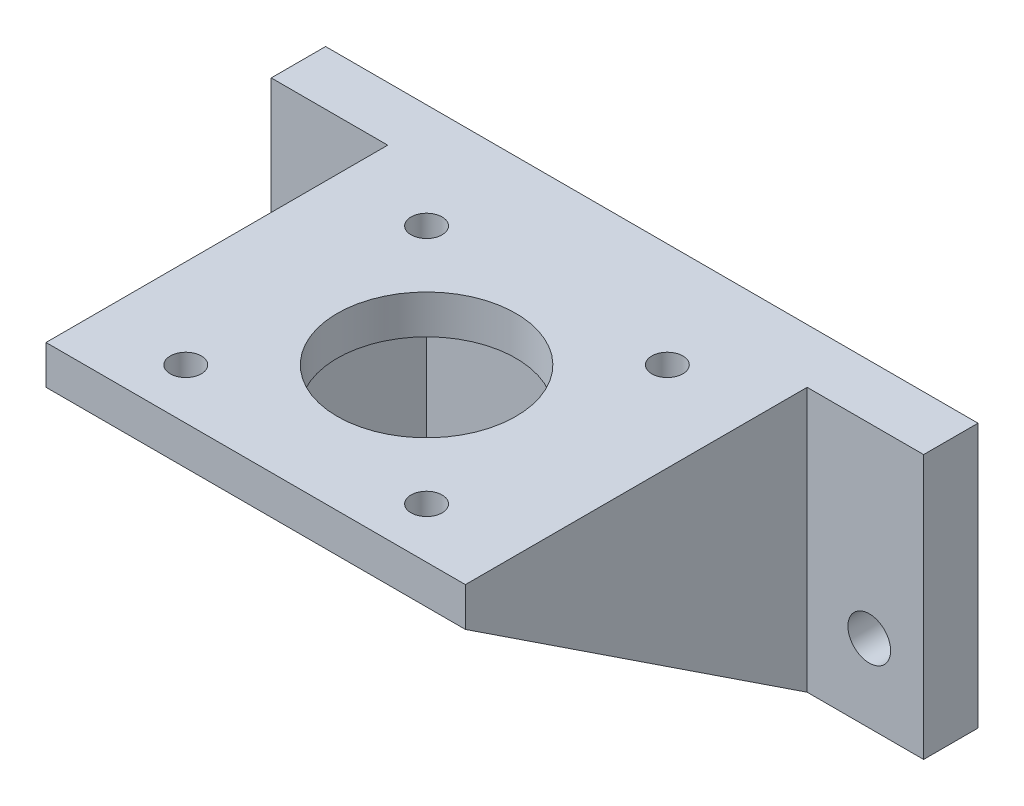
ISO-10303-21;
HEADER;
FILE_DESCRIPTION(('STEP AP214'),'2;1');
FILE_NAME('part.step','',(''),(''),'','','');
FILE_SCHEMA(('AUTOMOTIVE_DESIGN { 1 0 10303 214 1 1 1 1 }'));
ENDSEC;
DATA;
#1=APPLICATION_CONTEXT('core data for automotive mechanical design processes');
#2=APPLICATION_PROTOCOL_DEFINITION('international standard','automotive_design',2000,#1);
#3=PRODUCT_CONTEXT('',#1,'mechanical');
#4=PRODUCT('Part','Part','',(#3));
#5=PRODUCT_RELATED_PRODUCT_CATEGORY('part','',(#4));
#6=PRODUCT_DEFINITION_FORMATION('','',#4);
#7=PRODUCT_DEFINITION_CONTEXT('part definition',#1,'design');
#8=PRODUCT_DEFINITION('design','',#6,#7);
#9=PRODUCT_DEFINITION_SHAPE('','',#8);
#10=(LENGTH_UNIT() NAMED_UNIT(*) SI_UNIT(.MILLI.,.METRE.));
#11=(NAMED_UNIT(*) PLANE_ANGLE_UNIT() SI_UNIT($,.RADIAN.));
#12=(NAMED_UNIT(*) SI_UNIT($,.STERADIAN.) SOLID_ANGLE_UNIT());
#13=UNCERTAINTY_MEASURE_WITH_UNIT(LENGTH_MEASURE(1.E-05),#10,'distance_accuracy_value','');
#14=(GEOMETRIC_REPRESENTATION_CONTEXT(3) GLOBAL_UNCERTAINTY_ASSIGNED_CONTEXT((#13)) GLOBAL_UNIT_ASSIGNED_CONTEXT((#10,
#11,#12)) REPRESENTATION_CONTEXT('',''));
#15=CARTESIAN_POINT('',(0.,0.,0.));
#16=DIRECTION('',(0.,0.,1.));
#17=DIRECTION('',(1.,0.,0.));
#18=AXIS2_PLACEMENT_3D('',#15,#16,#17);
#19=CARTESIAN_POINT('',(0.,0.,-44.));
#20=DIRECTION('',(0.,0.,-1.));
#21=DIRECTION('',(-1.,0.,0.));
#22=AXIS2_PLACEMENT_3D('',#19,#20,#21);
#23=PLANE('',#22);
#24=CARTESIAN_POINT('',(-13.,-19.,-44.));
#25=DIRECTION('',(0.,0.,-1.));
#26=DIRECTION('',(-1.,0.,0.));
#27=AXIS2_PLACEMENT_3D('',#24,#25,#26);
#28=CIRCLE('',#27,2.75);
#29=CARTESIAN_POINT('',(-15.75,-19.,-44.));
#30=VERTEX_POINT('',#29);
#31=EDGE_CURVE('E165',#30,#30,#28,.T.);
#32=ORIENTED_EDGE('',*,*,#31,.T.);
#33=EDGE_LOOP('',(#32));
#34=FACE_BOUND('',#33,.T.);
#35=DIRECTION('',(0.,-1.,0.));
#36=VECTOR('',#35,1.);
#37=CARTESIAN_POINT('',(-5.,0.,-44.));
#38=LINE('',#37,#36);
#39=CARTESIAN_POINT('',(-5.,5.,-44.));
#40=VERTEX_POINT('',#39);
#41=CARTESIAN_POINT('',(-4.99999999999998,-29.,-44.));
#42=VERTEX_POINT('',#41);
#43=EDGE_CURVE('E121',#40,#42,#38,.T.);
#44=ORIENTED_EDGE('',*,*,#43,.F.);
#45=DIRECTION('',(1.,0.,0.));
#46=VECTOR('',#45,1.);
#47=CARTESIAN_POINT('',(64.,5.,-44.));
#48=LINE('',#47,#46);
#49=CARTESIAN_POINT('',(-20.,5.,-44.));
#50=VERTEX_POINT('',#49);
#51=EDGE_CURVE('E182',#50,#40,#48,.T.);
#52=ORIENTED_EDGE('',*,*,#51,.F.);
#53=DIRECTION('',(0.,1.,0.));
#54=VECTOR('',#53,1.);
#55=CARTESIAN_POINT('',(-20.,5.,-44.));
#56=LINE('',#55,#54);
#57=CARTESIAN_POINT('',(-20.,-29.,-44.));
#58=VERTEX_POINT('',#57);
#59=EDGE_CURVE('E195',#58,#50,#56,.T.);
#60=ORIENTED_EDGE('',*,*,#59,.F.);
#61=DIRECTION('',(-1.,0.,0.));
#62=VECTOR('',#61,1.);
#63=CARTESIAN_POINT('',(64.,-29.,-44.));
#64=LINE('',#63,#62);
#65=EDGE_CURVE('E191',#42,#58,#64,.T.);
#66=ORIENTED_EDGE('',*,*,#65,.F.);
#67=EDGE_LOOP('',(#44,#52,#60,#66));
#68=FACE_BOUND('',#67,.T.);
#69=ADVANCED_FACE('F33',(#34,#68),#23,.F.);
#70=CARTESIAN_POINT('',(57.,-19.,-44.));
#71=DIRECTION('',(0.,0.,-1.));
#72=DIRECTION('',(-1.,0.,0.));
#73=AXIS2_PLACEMENT_3D('',#70,#71,#72);
#74=CIRCLE('',#73,2.75);
#75=CARTESIAN_POINT('',(54.25,-19.,-44.));
#76=VERTEX_POINT('',#75);
#77=EDGE_CURVE('E169',#76,#76,#74,.T.);
#78=ORIENTED_EDGE('',*,*,#77,.T.);
#79=EDGE_LOOP('',(#78));
#80=FACE_BOUND('',#79,.T.);
#81=DIRECTION('',(0.,1.,0.));
#82=VECTOR('',#81,1.);
#83=CARTESIAN_POINT('',(49.,0.,-44.));
#84=LINE('',#83,#82);
#85=CARTESIAN_POINT('',(49.,-29.,-44.));
#86=VERTEX_POINT('',#85);
#87=CARTESIAN_POINT('',(49.,5.,-44.));
#88=VERTEX_POINT('',#87);
#89=EDGE_CURVE('E163',#86,#88,#84,.T.);
#90=ORIENTED_EDGE('',*,*,#89,.F.);
#91=CARTESIAN_POINT('',(64.,-29.,-44.));
#92=VERTEX_POINT('',#91);
#93=EDGE_CURVE('E192',#92,#86,#64,.T.);
#94=ORIENTED_EDGE('',*,*,#93,.F.);
#95=DIRECTION('',(0.,-1.,0.));
#96=VECTOR('',#95,1.);
#97=CARTESIAN_POINT('',(64.,5.,-44.));
#98=LINE('',#97,#96);
#99=CARTESIAN_POINT('',(64.,5.,-44.));
#100=VERTEX_POINT('',#99);
#101=EDGE_CURVE('E175',#100,#92,#98,.T.);
#102=ORIENTED_EDGE('',*,*,#101,.F.);
#103=EDGE_CURVE('E198',#88,#100,#48,.T.);
#104=ORIENTED_EDGE('',*,*,#103,.F.);
#105=EDGE_LOOP('',(#90,#94,#102,#104));
#106=FACE_BOUND('',#105,.T.);
#107=ADVANCED_FACE('F270',(#80,#106),#23,.F.);
#108=CARTESIAN_POINT('',(0.,5.,0.));
#109=DIRECTION('',(0.,-1.,0.));
#110=DIRECTION('',(0.,0.,-1.));
#111=AXIS2_PLACEMENT_3D('',#108,#109,#110);
#112=PLANE('',#111);
#113=DIRECTION('',(0.,0.,1.));
#114=VECTOR('',#113,1.);
#115=CARTESIAN_POINT('',(64.,5.,-51.));
#116=LINE('',#115,#114);
#117=CARTESIAN_POINT('',(64.,5.,-51.));
#118=VERTEX_POINT('',#117);
#119=EDGE_CURVE('E188',#118,#100,#116,.T.);
#120=ORIENTED_EDGE('',*,*,#119,.F.);
#121=DIRECTION('',(1.,0.,0.));
#122=VECTOR('',#121,1.);
#123=CARTESIAN_POINT('',(64.,5.,-51.));
#124=LINE('',#123,#122);
#125=CARTESIAN_POINT('',(-20.,5.,-51.));
#126=VERTEX_POINT('',#125);
#127=EDGE_CURVE('E186',#126,#118,#124,.T.);
#128=ORIENTED_EDGE('',*,*,#127,.F.);
#129=DIRECTION('',(0.,0.,1.));
#130=VECTOR('',#129,1.);
#131=CARTESIAN_POINT('',(-20.,5.,-51.));
#132=LINE('',#131,#130);
#133=EDGE_CURVE('E203',#126,#50,#132,.T.);
#134=ORIENTED_EDGE('',*,*,#133,.T.);
#135=ORIENTED_EDGE('',*,*,#51,.T.);
#136=DIRECTION('',(0.,0.,-1.));
#137=VECTOR('',#136,1.);
#138=CARTESIAN_POINT('',(-5.,5.,-51.));
#139=LINE('',#138,#137);
#140=CARTESIAN_POINT('',(-5.,5.,0.));
#141=VERTEX_POINT('',#140);
#142=EDGE_CURVE('E134',#141,#40,#139,.T.);
#143=ORIENTED_EDGE('',*,*,#142,.F.);
#144=DIRECTION('',(1.,0.,0.));
#145=VECTOR('',#144,1.);
#146=CARTESIAN_POINT('',(0.,5.,0.));
#147=LINE('',#146,#145);
#148=CARTESIAN_POINT('',(49.,5.,0.));
#149=VERTEX_POINT('',#148);
#150=EDGE_CURVE('E11',#141,#149,#147,.T.);
#151=ORIENTED_EDGE('',*,*,#150,.T.);
#152=DIRECTION('',(0.,0.,1.));
#153=VECTOR('',#152,1.);
#154=CARTESIAN_POINT('',(49.,5.,0.));
#155=LINE('',#154,#153);
#156=EDGE_CURVE('E151',#88,#149,#155,.T.);
#157=ORIENTED_EDGE('',*,*,#156,.F.);
#158=ORIENTED_EDGE('',*,*,#103,.T.);
#159=EDGE_LOOP('',(#120,#128,#134,#135,#143,#151,#157,#158));
#160=FACE_BOUND('',#159,.T.);
#161=CARTESIAN_POINT('',(6.5,5.,-37.5));
#162=DIRECTION('',(0.,1.,0.));
#163=DIRECTION('',(0.,0.,1.));
#164=AXIS2_PLACEMENT_3D('',#161,#162,#163);
#165=CIRCLE('',#164,2.);
#166=CARTESIAN_POINT('',(6.5,5.,-35.5));
#167=VERTEX_POINT('',#166);
#168=EDGE_CURVE('E237',#167,#167,#165,.T.);
#169=ORIENTED_EDGE('',*,*,#168,.F.);
#170=EDGE_LOOP('',(#169));
#171=FACE_BOUND('',#170,.T.);
#172=CARTESIAN_POINT('',(6.50000000000003,5.,-6.5));
#173=DIRECTION('',(0.,1.,0.));
#174=DIRECTION('',(0.,0.,1.));
#175=AXIS2_PLACEMENT_3D('',#172,#173,#174);
#176=CIRCLE('',#175,2.);
#177=CARTESIAN_POINT('',(6.50000000000003,5.,-4.5));
#178=VERTEX_POINT('',#177);
#179=EDGE_CURVE('E231',#178,#178,#176,.T.);
#180=ORIENTED_EDGE('',*,*,#179,.F.);
#181=EDGE_LOOP('',(#180));
#182=FACE_BOUND('',#181,.T.);
#183=CARTESIAN_POINT('',(37.5,5.,-6.5));
#184=DIRECTION('',(0.,1.,0.));
#185=DIRECTION('',(0.,0.,1.));
#186=AXIS2_PLACEMENT_3D('',#183,#184,#185);
#187=CIRCLE('',#186,2.);
#188=CARTESIAN_POINT('',(37.5,5.,-4.5));
#189=VERTEX_POINT('',#188);
#190=EDGE_CURVE('E225',#189,#189,#187,.T.);
#191=ORIENTED_EDGE('',*,*,#190,.F.);
#192=EDGE_LOOP('',(#191));
#193=FACE_BOUND('',#192,.T.);
#194=CARTESIAN_POINT('',(37.5,5.,-37.5));
#195=DIRECTION('',(0.,1.,0.));
#196=DIRECTION('',(0.,0.,1.));
#197=AXIS2_PLACEMENT_3D('',#194,#195,#196);
#198=CIRCLE('',#197,2.);
#199=CARTESIAN_POINT('',(37.5,5.,-35.5));
#200=VERTEX_POINT('',#199);
#201=EDGE_CURVE('E219',#200,#200,#198,.T.);
#202=ORIENTED_EDGE('',*,*,#201,.F.);
#203=EDGE_LOOP('',(#202));
#204=FACE_BOUND('',#203,.T.);
#205=CARTESIAN_POINT('',(22.,5.,-22.));
#206=DIRECTION('',(0.,1.,0.));
#207=DIRECTION('',(0.,0.,1.));
#208=AXIS2_PLACEMENT_3D('',#205,#206,#207);
#209=CIRCLE('',#208,11.5);
#210=CARTESIAN_POINT('',(22.,5.,-10.5));
#211=VERTEX_POINT('',#210);
#212=EDGE_CURVE('E213',#211,#211,#209,.T.);
#213=ORIENTED_EDGE('',*,*,#212,.F.);
#214=EDGE_LOOP('',(#213));
#215=FACE_BOUND('',#214,.T.);
#216=ADVANCED_FACE('F276',(#160,#171,#182,#193,#204,#215),#112,.F.);
#217=CARTESIAN_POINT('',(0.,0.,0.));
#218=DIRECTION('',(0.,-1.,0.));
#219=DIRECTION('',(0.,0.,-1.));
#220=AXIS2_PLACEMENT_3D('',#217,#218,#219);
#221=PLANE('',#220);
#222=CARTESIAN_POINT('',(37.5,0.,-37.5));
#223=DIRECTION('',(0.,1.,0.));
#224=DIRECTION('',(0.,0.,1.));
#225=AXIS2_PLACEMENT_3D('',#222,#223,#224);
#226=CIRCLE('',#225,2.);
#227=CARTESIAN_POINT('',(37.5,0.,-35.5));
#228=VERTEX_POINT('',#227);
#229=EDGE_CURVE('E216',#228,#228,#226,.T.);
#230=ORIENTED_EDGE('',*,*,#229,.T.);
#231=EDGE_LOOP('',(#230));
#232=FACE_BOUND('',#231,.T.);
#233=CARTESIAN_POINT('',(6.50000000000003,0.,-6.5));
#234=DIRECTION('',(0.,1.,0.));
#235=DIRECTION('',(0.,0.,1.));
#236=AXIS2_PLACEMENT_3D('',#233,#234,#235);
#237=CIRCLE('',#236,2.);
#238=CARTESIAN_POINT('',(6.50000000000003,0.,-4.5));
#239=VERTEX_POINT('',#238);
#240=EDGE_CURVE('E228',#239,#239,#237,.T.);
#241=ORIENTED_EDGE('',*,*,#240,.T.);
#242=EDGE_LOOP('',(#241));
#243=FACE_BOUND('',#242,.T.);
#244=DIRECTION('',(0.,0.,1.));
#245=VECTOR('',#244,1.);
#246=CARTESIAN_POINT('',(0.,0.,0.));
#247=LINE('',#246,#245);
#248=CARTESIAN_POINT('',(0.,0.,-44.));
#249=VERTEX_POINT('',#248);
#250=CARTESIAN_POINT('',(0.,0.,0.));
#251=VERTEX_POINT('',#250);
#252=EDGE_CURVE('E240',#249,#251,#247,.T.);
#253=ORIENTED_EDGE('',*,*,#252,.F.);
#254=DIRECTION('',(-1.,0.,0.));
#255=VECTOR('',#254,1.);
#256=CARTESIAN_POINT('',(0.,0.,-44.));
#257=LINE('',#256,#255);
#258=CARTESIAN_POINT('',(44.,0.,-44.));
#259=VERTEX_POINT('',#258);
#260=EDGE_CURVE('E37',#259,#249,#257,.T.);
#261=ORIENTED_EDGE('',*,*,#260,.F.);
#262=DIRECTION('',(0.,0.,-1.));
#263=VECTOR('',#262,1.);
#264=CARTESIAN_POINT('',(44.,0.,0.));
#265=LINE('',#264,#263);
#266=CARTESIAN_POINT('',(44.,0.,0.));
#267=VERTEX_POINT('',#266);
#268=EDGE_CURVE('E245',#267,#259,#265,.T.);
#269=ORIENTED_EDGE('',*,*,#268,.F.);
#270=DIRECTION('',(1.,0.,0.));
#271=VECTOR('',#270,1.);
#272=CARTESIAN_POINT('',(0.,0.,0.));
#273=LINE('',#272,#271);
#274=EDGE_CURVE('E244',#251,#267,#273,.T.);
#275=ORIENTED_EDGE('',*,*,#274,.F.);
#276=EDGE_LOOP('',(#253,#261,#269,#275));
#277=FACE_BOUND('',#276,.T.);
#278=CARTESIAN_POINT('',(6.5,0.,-37.5));
#279=DIRECTION('',(0.,1.,0.));
#280=DIRECTION('',(0.,0.,1.));
#281=AXIS2_PLACEMENT_3D('',#278,#279,#280);
#282=CIRCLE('',#281,2.);
#283=CARTESIAN_POINT('',(6.5,0.,-35.5));
#284=VERTEX_POINT('',#283);
#285=EDGE_CURVE('E234',#284,#284,#282,.T.);
#286=ORIENTED_EDGE('',*,*,#285,.T.);
#287=EDGE_LOOP('',(#286));
#288=FACE_BOUND('',#287,.T.);
#289=CARTESIAN_POINT('',(37.5,0.,-6.5));
#290=DIRECTION('',(0.,1.,0.));
#291=DIRECTION('',(0.,0.,1.));
#292=AXIS2_PLACEMENT_3D('',#289,#290,#291);
#293=CIRCLE('',#292,2.);
#294=CARTESIAN_POINT('',(37.5,0.,-4.5));
#295=VERTEX_POINT('',#294);
#296=EDGE_CURVE('E222',#295,#295,#293,.T.);
#297=ORIENTED_EDGE('',*,*,#296,.T.);
#298=EDGE_LOOP('',(#297));
#299=FACE_BOUND('',#298,.T.);
#300=CARTESIAN_POINT('',(22.,0.,-22.));
#301=DIRECTION('',(0.,1.,0.));
#302=DIRECTION('',(0.,0.,1.));
#303=AXIS2_PLACEMENT_3D('',#300,#301,#302);
#304=CIRCLE('',#303,11.5);
#305=CARTESIAN_POINT('',(22.,0.,-10.5));
#306=VERTEX_POINT('',#305);
#307=EDGE_CURVE('E212',#306,#306,#304,.T.);
#308=ORIENTED_EDGE('',*,*,#307,.T.);
#309=EDGE_LOOP('',(#308));
#310=FACE_BOUND('',#309,.T.);
#311=ADVANCED_FACE('F256',(#232,#243,#277,#288,#299,#310),#221,.T.);
#312=CARTESIAN_POINT('',(0.,5.,0.));
#313=DIRECTION('',(0.,0.,-1.));
#314=DIRECTION('',(-1.,0.,0.));
#315=AXIS2_PLACEMENT_3D('',#312,#313,#314);
#316=PLANE('',#315);
#317=ORIENTED_EDGE('',*,*,#274,.T.);
#318=DIRECTION('',(-1.,0.,0.));
#319=VECTOR('',#318,1.);
#320=CARTESIAN_POINT('',(49.,0.,0.));
#321=LINE('',#320,#319);
#322=CARTESIAN_POINT('',(49.,0.,0.));
#323=VERTEX_POINT('',#322);
#324=EDGE_CURVE('E158',#323,#267,#321,.T.);
#325=ORIENTED_EDGE('',*,*,#324,.F.);
#326=DIRECTION('',(0.,-1.,0.));
#327=VECTOR('',#326,1.);
#328=CARTESIAN_POINT('',(49.,0.,0.));
#329=LINE('',#328,#327);
#330=EDGE_CURVE('E146',#149,#323,#329,.T.);
#331=ORIENTED_EDGE('',*,*,#330,.F.);
#332=ORIENTED_EDGE('',*,*,#150,.F.);
#333=DIRECTION('',(0.,1.,0.));
#334=VECTOR('',#333,1.);
#335=CARTESIAN_POINT('',(-5.,5.,0.));
#336=LINE('',#335,#334);
#337=CARTESIAN_POINT('',(-5.,0.,0.));
#338=VERTEX_POINT('',#337);
#339=EDGE_CURVE('E118',#338,#141,#336,.T.);
#340=ORIENTED_EDGE('',*,*,#339,.F.);
#341=DIRECTION('',(1.,0.,0.));
#342=VECTOR('',#341,1.);
#343=CARTESIAN_POINT('',(-5.,0.,0.));
#344=LINE('',#343,#342);
#345=EDGE_CURVE('E127',#338,#251,#344,.T.);
#346=ORIENTED_EDGE('',*,*,#345,.T.);
#347=EDGE_LOOP('',(#317,#325,#331,#332,#340,#346));
#348=FACE_BOUND('',#347,.T.);
#349=ADVANCED_FACE('F35',(#348),#316,.F.);
#350=CARTESIAN_POINT('',(6.5,5.,-37.5));
#351=DIRECTION('',(0.,-1.,0.));
#352=DIRECTION('',(0.,0.,-1.));
#353=AXIS2_PLACEMENT_3D('',#350,#351,#352);
#354=CYLINDRICAL_SURFACE('',#353,2.);
#355=ORIENTED_EDGE('',*,*,#168,.T.);
#356=EDGE_LOOP('',(#355));
#357=FACE_BOUND('',#356,.T.);
#358=ORIENTED_EDGE('',*,*,#285,.F.);
#359=EDGE_LOOP('',(#358));
#360=FACE_BOUND('',#359,.T.);
#361=ADVANCED_FACE('F356',(#357,#360),#354,.F.);
#362=CARTESIAN_POINT('',(6.50000000000003,5.,-6.5));
#363=DIRECTION('',(0.,-1.,0.));
#364=DIRECTION('',(0.,0.,-1.));
#365=AXIS2_PLACEMENT_3D('',#362,#363,#364);
#366=CYLINDRICAL_SURFACE('',#365,2.);
#367=ORIENTED_EDGE('',*,*,#179,.T.);
#368=EDGE_LOOP('',(#367));
#369=FACE_BOUND('',#368,.T.);
#370=ORIENTED_EDGE('',*,*,#240,.F.);
#371=EDGE_LOOP('',(#370));
#372=FACE_BOUND('',#371,.T.);
#373=ADVANCED_FACE('F352',(#369,#372),#366,.F.);
#374=CARTESIAN_POINT('',(37.5,5.,-6.5));
#375=DIRECTION('',(0.,-1.,0.));
#376=DIRECTION('',(0.,0.,-1.));
#377=AXIS2_PLACEMENT_3D('',#374,#375,#376);
#378=CYLINDRICAL_SURFACE('',#377,2.);
#379=ORIENTED_EDGE('',*,*,#190,.T.);
#380=EDGE_LOOP('',(#379));
#381=FACE_BOUND('',#380,.T.);
#382=ORIENTED_EDGE('',*,*,#296,.F.);
#383=EDGE_LOOP('',(#382));
#384=FACE_BOUND('',#383,.T.);
#385=ADVANCED_FACE('F348',(#381,#384),#378,.F.);
#386=CARTESIAN_POINT('',(37.5,5.,-37.5));
#387=DIRECTION('',(0.,-1.,0.));
#388=DIRECTION('',(0.,0.,-1.));
#389=AXIS2_PLACEMENT_3D('',#386,#387,#388);
#390=CYLINDRICAL_SURFACE('',#389,2.);
#391=ORIENTED_EDGE('',*,*,#201,.T.);
#392=EDGE_LOOP('',(#391));
#393=FACE_BOUND('',#392,.T.);
#394=ORIENTED_EDGE('',*,*,#229,.F.);
#395=EDGE_LOOP('',(#394));
#396=FACE_BOUND('',#395,.T.);
#397=ADVANCED_FACE('F296',(#393,#396),#390,.F.);
#398=CARTESIAN_POINT('',(22.,5.,-22.));
#399=DIRECTION('',(0.,-1.,0.));
#400=DIRECTION('',(0.,0.,-1.));
#401=AXIS2_PLACEMENT_3D('',#398,#399,#400);
#402=CYLINDRICAL_SURFACE('',#401,11.5);
#403=ORIENTED_EDGE('',*,*,#212,.T.);
#404=EDGE_LOOP('',(#403));
#405=FACE_BOUND('',#404,.T.);
#406=ORIENTED_EDGE('',*,*,#307,.F.);
#407=EDGE_LOOP('',(#406));
#408=FACE_BOUND('',#407,.T.);
#409=ADVANCED_FACE('F291',(#405,#408),#402,.F.);
#410=CARTESIAN_POINT('',(0.,0.,-51.));
#411=DIRECTION('',(0.,0.,-1.));
#412=DIRECTION('',(-1.,0.,0.));
#413=AXIS2_PLACEMENT_3D('',#410,#411,#412);
#414=PLANE('',#413);
#415=DIRECTION('',(-1.,0.,0.));
#416=VECTOR('',#415,1.);
#417=CARTESIAN_POINT('',(64.,-29.,-51.));
#418=LINE('',#417,#416);
#419=CARTESIAN_POINT('',(64.,-29.,-51.));
#420=VERTEX_POINT('',#419);
#421=CARTESIAN_POINT('',(-20.,-29.,-51.));
#422=VERTEX_POINT('',#421);
#423=EDGE_CURVE('E181',#420,#422,#418,.T.);
#424=ORIENTED_EDGE('',*,*,#423,.T.);
#425=DIRECTION('',(0.,1.,0.));
#426=VECTOR('',#425,1.);
#427=CARTESIAN_POINT('',(-20.,5.,-51.));
#428=LINE('',#427,#426);
#429=EDGE_CURVE('E184',#422,#126,#428,.T.);
#430=ORIENTED_EDGE('',*,*,#429,.T.);
#431=ORIENTED_EDGE('',*,*,#127,.T.);
#432=DIRECTION('',(0.,-1.,0.));
#433=VECTOR('',#432,1.);
#434=CARTESIAN_POINT('',(64.,5.,-51.));
#435=LINE('',#434,#433);
#436=EDGE_CURVE('E178',#118,#420,#435,.T.);
#437=ORIENTED_EDGE('',*,*,#436,.T.);
#438=EDGE_LOOP('',(#424,#430,#431,#437));
#439=FACE_BOUND('',#438,.T.);
#440=CARTESIAN_POINT('',(57.,-19.,-51.));
#441=DIRECTION('',(0.,0.,-1.));
#442=DIRECTION('',(-1.,0.,0.));
#443=AXIS2_PLACEMENT_3D('',#440,#441,#442);
#444=CIRCLE('',#443,2.75);
#445=CARTESIAN_POINT('',(54.25,-19.,-51.));
#446=VERTEX_POINT('',#445);
#447=EDGE_CURVE('E172',#446,#446,#444,.T.);
#448=ORIENTED_EDGE('',*,*,#447,.F.);
#449=EDGE_LOOP('',(#448));
#450=FACE_BOUND('',#449,.T.);
#451=CARTESIAN_POINT('',(-13.,-19.,-51.));
#452=DIRECTION('',(0.,0.,-1.));
#453=DIRECTION('',(-1.,0.,0.));
#454=AXIS2_PLACEMENT_3D('',#451,#452,#453);
#455=CIRCLE('',#454,2.75);
#456=CARTESIAN_POINT('',(-15.75,-19.,-51.));
#457=VERTEX_POINT('',#456);
#458=EDGE_CURVE('E166',#457,#457,#455,.T.);
#459=ORIENTED_EDGE('',*,*,#458,.F.);
#460=EDGE_LOOP('',(#459));
#461=FACE_BOUND('',#460,.T.);
#462=ADVANCED_FACE('F283',(#439,#450,#461),#414,.T.);
#463=ORIENTED_EDGE('',*,*,#260,.T.);
#464=DIRECTION('',(0.,-1.,0.));
#465=VECTOR('',#464,1.);
#466=CARTESIAN_POINT('',(0.,0.,-44.));
#467=LINE('',#466,#465);
#468=CARTESIAN_POINT('',(0.,-29.,-44.));
#469=VERTEX_POINT('',#468);
#470=EDGE_CURVE('E142',#249,#469,#467,.T.);
#471=ORIENTED_EDGE('',*,*,#470,.T.);
#472=CARTESIAN_POINT('',(44.,-29.,-44.));
#473=VERTEX_POINT('',#472);
#474=EDGE_CURVE('E196',#473,#469,#64,.T.);
#475=ORIENTED_EDGE('',*,*,#474,.F.);
#476=DIRECTION('',(0.,1.,0.));
#477=VECTOR('',#476,1.);
#478=CARTESIAN_POINT('',(44.,0.,-44.));
#479=LINE('',#478,#477);
#480=EDGE_CURVE('E160',#473,#259,#479,.T.);
#481=ORIENTED_EDGE('',*,*,#480,.T.);
#482=EDGE_LOOP('',(#463,#471,#475,#481));
#483=FACE_BOUND('',#482,.T.);
#484=ADVANCED_FACE('F251',(#483),#23,.F.);
#485=CARTESIAN_POINT('',(64.,5.,-51.));
#486=DIRECTION('',(-1.,0.,0.));
#487=DIRECTION('',(0.,0.,1.));
#488=AXIS2_PLACEMENT_3D('',#485,#486,#487);
#489=PLANE('',#488);
#490=ORIENTED_EDGE('',*,*,#101,.T.);
#491=DIRECTION('',(0.,0.,1.));
#492=VECTOR('',#491,1.);
#493=CARTESIAN_POINT('',(64.,-29.,-51.));
#494=LINE('',#493,#492);
#495=EDGE_CURVE('E209',#420,#92,#494,.T.);
#496=ORIENTED_EDGE('',*,*,#495,.F.);
#497=ORIENTED_EDGE('',*,*,#436,.F.);
#498=ORIENTED_EDGE('',*,*,#119,.T.);
#499=EDGE_LOOP('',(#490,#496,#497,#498));
#500=FACE_BOUND('',#499,.T.);
#501=ADVANCED_FACE('F282',(#500),#489,.F.);
#502=CARTESIAN_POINT('',(64.,-29.,-51.));
#503=DIRECTION('',(0.,1.,0.));
#504=DIRECTION('',(0.,0.,1.));
#505=AXIS2_PLACEMENT_3D('',#502,#503,#504);
#506=PLANE('',#505);
#507=ORIENTED_EDGE('',*,*,#474,.T.);
#508=DIRECTION('',(1.,0.,0.));
#509=VECTOR('',#508,1.);
#510=CARTESIAN_POINT('',(-5.,-29.,-44.));
#511=LINE('',#510,#509);
#512=EDGE_CURVE('E133',#42,#469,#511,.T.);
#513=ORIENTED_EDGE('',*,*,#512,.F.);
#514=ORIENTED_EDGE('',*,*,#65,.T.);
#515=DIRECTION('',(0.,0.,1.));
#516=VECTOR('',#515,1.);
#517=CARTESIAN_POINT('',(-20.,-29.,-51.));
#518=LINE('',#517,#516);
#519=EDGE_CURVE('E206',#422,#58,#518,.T.);
#520=ORIENTED_EDGE('',*,*,#519,.F.);
#521=ORIENTED_EDGE('',*,*,#423,.F.);
#522=ORIENTED_EDGE('',*,*,#495,.T.);
#523=ORIENTED_EDGE('',*,*,#93,.T.);
#524=DIRECTION('',(-1.,0.,0.));
#525=VECTOR('',#524,1.);
#526=CARTESIAN_POINT('',(49.,-29.,-44.));
#527=LINE('',#526,#525);
#528=EDGE_CURVE('E154',#86,#473,#527,.T.);
#529=ORIENTED_EDGE('',*,*,#528,.T.);
#530=EDGE_LOOP('',(#507,#513,#514,#520,#521,#522,#523,#529));
#531=FACE_BOUND('',#530,.T.);
#532=ADVANCED_FACE('F288',(#531),#506,.F.);
#533=CARTESIAN_POINT('',(-20.,5.,-51.));
#534=DIRECTION('',(1.,0.,0.));
#535=DIRECTION('',(0.,1.,0.));
#536=AXIS2_PLACEMENT_3D('',#533,#534,#535);
#537=PLANE('',#536);
#538=ORIENTED_EDGE('',*,*,#59,.T.);
#539=ORIENTED_EDGE('',*,*,#133,.F.);
#540=ORIENTED_EDGE('',*,*,#429,.F.);
#541=ORIENTED_EDGE('',*,*,#519,.T.);
#542=EDGE_LOOP('',(#538,#539,#540,#541));
#543=FACE_BOUND('',#542,.T.);
#544=ADVANCED_FACE('F305',(#543),#537,.F.);
#545=CARTESIAN_POINT('',(57.,-19.,-51.));
#546=DIRECTION('',(0.,0.,1.));
#547=DIRECTION('',(1.,0.,0.));
#548=AXIS2_PLACEMENT_3D('',#545,#546,#547);
#549=CYLINDRICAL_SURFACE('',#548,2.75);
#550=ORIENTED_EDGE('',*,*,#447,.T.);
#551=EDGE_LOOP('',(#550));
#552=FACE_BOUND('',#551,.T.);
#553=ORIENTED_EDGE('',*,*,#77,.F.);
#554=EDGE_LOOP('',(#553));
#555=FACE_BOUND('',#554,.T.);
#556=ADVANCED_FACE('F301',(#552,#555),#549,.F.);
#557=CARTESIAN_POINT('',(-13.,-19.,-51.));
#558=DIRECTION('',(0.,0.,1.));
#559=DIRECTION('',(1.,0.,0.));
#560=AXIS2_PLACEMENT_3D('',#557,#558,#559);
#561=CYLINDRICAL_SURFACE('',#560,2.75);
#562=ORIENTED_EDGE('',*,*,#458,.T.);
#563=EDGE_LOOP('',(#562));
#564=FACE_BOUND('',#563,.T.);
#565=ORIENTED_EDGE('',*,*,#31,.F.);
#566=EDGE_LOOP('',(#565));
#567=FACE_BOUND('',#566,.T.);
#568=ADVANCED_FACE('F304',(#564,#567),#561,.F.);
#569=CARTESIAN_POINT('',(49.,0.,0.));
#570=DIRECTION('',(-1.,0.,0.));
#571=DIRECTION('',(0.,0.,1.));
#572=AXIS2_PLACEMENT_3D('',#569,#570,#571);
#573=PLANE('',#572);
#574=DIRECTION('',(0.,-0.550313362133823,-0.834958204616835));
#575=VECTOR('',#574,1.);
#576=CARTESIAN_POINT('',(49.,-29.,-44.));
#577=LINE('',#576,#575);
#578=EDGE_CURVE('E149',#323,#86,#577,.T.);
#579=ORIENTED_EDGE('',*,*,#578,.T.);
#580=ORIENTED_EDGE('',*,*,#89,.T.);
#581=ORIENTED_EDGE('',*,*,#156,.T.);
#582=ORIENTED_EDGE('',*,*,#330,.T.);
#583=EDGE_LOOP('',(#579,#580,#581,#582));
#584=FACE_BOUND('',#583,.T.);
#585=ADVANCED_FACE('F309',(#584),#573,.F.);
#586=CARTESIAN_POINT('',(44.,0.,0.));
#587=DIRECTION('',(-1.,0.,0.));
#588=DIRECTION('',(0.,0.,1.));
#589=AXIS2_PLACEMENT_3D('',#586,#587,#588);
#590=PLANE('',#589);
#591=DIRECTION('',(0.,-0.550313362133823,-0.834958204616835));
#592=VECTOR('',#591,1.);
#593=CARTESIAN_POINT('',(44.,-29.,-44.));
#594=LINE('',#593,#592);
#595=EDGE_CURVE('E57',#267,#473,#594,.T.);
#596=ORIENTED_EDGE('',*,*,#595,.F.);
#597=ORIENTED_EDGE('',*,*,#268,.T.);
#598=ORIENTED_EDGE('',*,*,#480,.F.);
#599=EDGE_LOOP('',(#596,#597,#598));
#600=FACE_BOUND('',#599,.T.);
#601=ADVANCED_FACE('F313',(#600),#590,.T.);
#602=CARTESIAN_POINT('',(49.,-29.,-44.));
#603=DIRECTION('',(0.,0.834958204616835,-0.550313362133823));
#604=DIRECTION('',(0.,0.550313362133823,0.834958204616835));
#605=AXIS2_PLACEMENT_3D('',#602,#603,#604);
#606=PLANE('',#605);
#607=ORIENTED_EDGE('',*,*,#595,.T.);
#608=ORIENTED_EDGE('',*,*,#528,.F.);
#609=ORIENTED_EDGE('',*,*,#578,.F.);
#610=ORIENTED_EDGE('',*,*,#324,.T.);
#611=EDGE_LOOP('',(#607,#608,#609,#610));
#612=FACE_BOUND('',#611,.T.);
#613=ADVANCED_FACE('F267',(#612),#606,.F.);
#614=CARTESIAN_POINT('',(-5.,0.,0.));
#615=DIRECTION('',(1.,0.,0.));
#616=DIRECTION('',(0.,0.,-1.));
#617=AXIS2_PLACEMENT_3D('',#614,#615,#616);
#618=PLANE('',#617);
#619=ORIENTED_EDGE('',*,*,#142,.T.);
#620=ORIENTED_EDGE('',*,*,#43,.T.);
#621=DIRECTION('',(0.,0.550313362133823,0.834958204616835));
#622=VECTOR('',#621,1.);
#623=CARTESIAN_POINT('',(-5.,0.,0.));
#624=LINE('',#623,#622);
#625=EDGE_CURVE('E49',#42,#338,#624,.T.);
#626=ORIENTED_EDGE('',*,*,#625,.T.);
#627=ORIENTED_EDGE('',*,*,#339,.T.);
#628=EDGE_LOOP('',(#619,#620,#626,#627));
#629=FACE_BOUND('',#628,.T.);
#630=ADVANCED_FACE('F116',(#629),#618,.F.);
#631=CARTESIAN_POINT('',(0.,0.,0.));
#632=DIRECTION('',(1.,0.,0.));
#633=DIRECTION('',(0.,0.,-1.));
#634=AXIS2_PLACEMENT_3D('',#631,#632,#633);
#635=PLANE('',#634);
#636=ORIENTED_EDGE('',*,*,#470,.F.);
#637=ORIENTED_EDGE('',*,*,#252,.T.);
#638=DIRECTION('',(0.,0.550313362133823,0.834958204616835));
#639=VECTOR('',#638,1.);
#640=CARTESIAN_POINT('',(0.,0.,0.));
#641=LINE('',#640,#639);
#642=EDGE_CURVE('E123',#469,#251,#641,.T.);
#643=ORIENTED_EDGE('',*,*,#642,.F.);
#644=EDGE_LOOP('',(#636,#637,#643));
#645=FACE_BOUND('',#644,.T.);
#646=ADVANCED_FACE('F259',(#645),#635,.T.);
#647=CARTESIAN_POINT('',(-5.,0.,0.));
#648=DIRECTION('',(0.,0.834958204616835,-0.550313362133823));
#649=DIRECTION('',(0.,0.550313362133823,0.834958204616835));
#650=AXIS2_PLACEMENT_3D('',#647,#648,#649);
#651=PLANE('',#650);
#652=ORIENTED_EDGE('',*,*,#642,.T.);
#653=ORIENTED_EDGE('',*,*,#345,.F.);
#654=ORIENTED_EDGE('',*,*,#625,.F.);
#655=ORIENTED_EDGE('',*,*,#512,.T.);
#656=EDGE_LOOP('',(#652,#653,#654,#655));
#657=FACE_BOUND('',#656,.T.);
#658=ADVANCED_FACE('F128',(#657),#651,.F.);
#659=CLOSED_SHELL('',(#69,#107,#216,#311,#349,#361,#373,#385,#397,#409,#462,#484,#501,#532,#544,
#556,#568,#585,#601,#613,#630,#646,#658));
#660=MANIFOLD_SOLID_BREP('B2',#659);
#661=ADVANCED_BREP_SHAPE_REPRESENTATION('',(#18,#660),#14);
#662=SHAPE_DEFINITION_REPRESENTATION(#9,#661);
ENDSEC;
END-ISO-10303-21;
